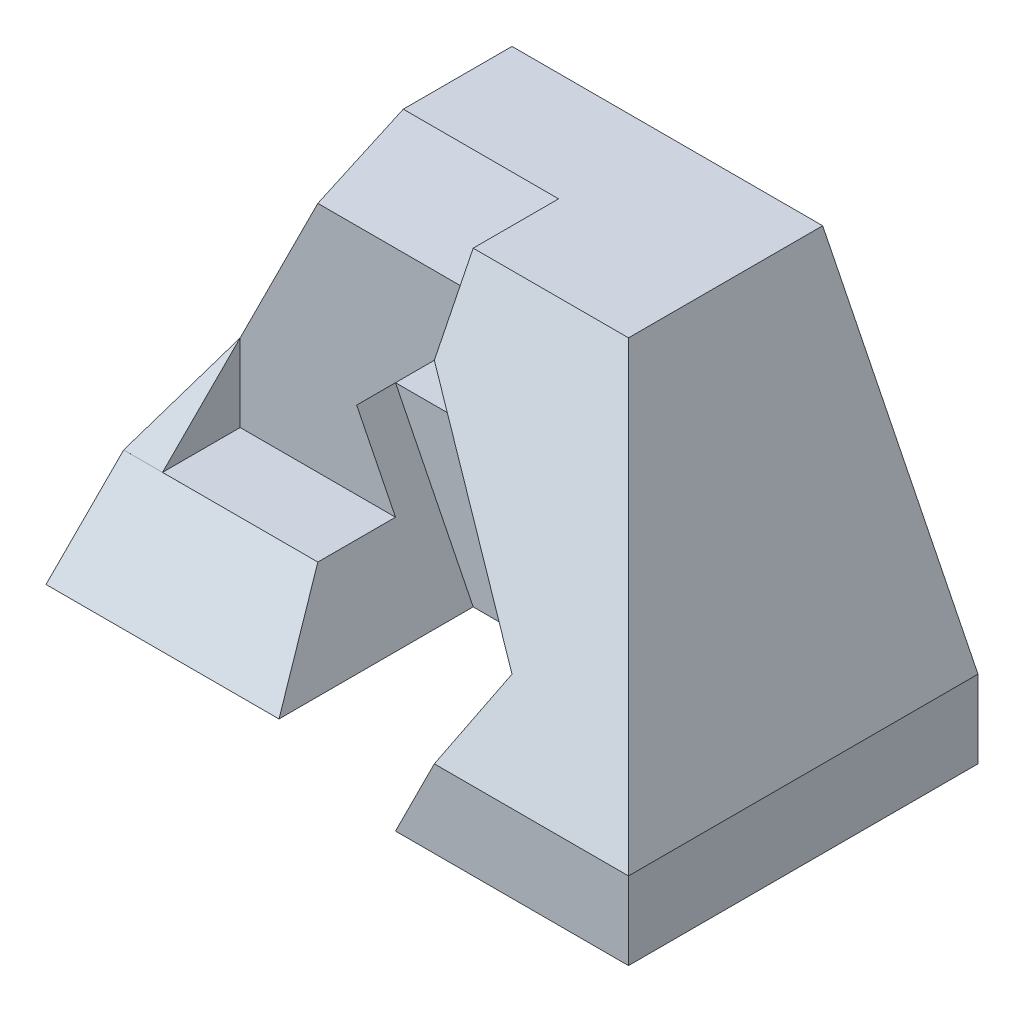
ISO-10303-21;
HEADER;
FILE_DESCRIPTION(('STEP AP214'),'2;1');
FILE_NAME('part.step','',(''),(''),'','','');
FILE_SCHEMA(('AUTOMOTIVE_DESIGN { 1 0 10303 214 1 1 1 1 }'));
ENDSEC;
DATA;
#1=APPLICATION_CONTEXT('core data for automotive mechanical design processes');
#2=APPLICATION_PROTOCOL_DEFINITION('international standard','automotive_design',2000,#1);
#3=PRODUCT_CONTEXT('',#1,'mechanical');
#4=PRODUCT('Part','Part','',(#3));
#5=PRODUCT_RELATED_PRODUCT_CATEGORY('part','',(#4));
#6=PRODUCT_DEFINITION_FORMATION('','',#4);
#7=PRODUCT_DEFINITION_CONTEXT('part definition',#1,'design');
#8=PRODUCT_DEFINITION('design','',#6,#7);
#9=PRODUCT_DEFINITION_SHAPE('','',#8);
#10=(LENGTH_UNIT() NAMED_UNIT(*) SI_UNIT(.MILLI.,.METRE.));
#11=(NAMED_UNIT(*) PLANE_ANGLE_UNIT() SI_UNIT($,.RADIAN.));
#12=(NAMED_UNIT(*) SI_UNIT($,.STERADIAN.) SOLID_ANGLE_UNIT());
#13=UNCERTAINTY_MEASURE_WITH_UNIT(LENGTH_MEASURE(1.E-05),#10,'distance_accuracy_value','');
#14=(GEOMETRIC_REPRESENTATION_CONTEXT(3) GLOBAL_UNCERTAINTY_ASSIGNED_CONTEXT((#13)) GLOBAL_UNIT_ASSIGNED_CONTEXT((#10,
#11,#12)) REPRESENTATION_CONTEXT('',''));
#15=CARTESIAN_POINT('',(0.,0.,0.));
#16=DIRECTION('',(0.,0.,1.));
#17=DIRECTION('',(1.,0.,0.));
#18=AXIS2_PLACEMENT_3D('',#15,#16,#17);
#19=CARTESIAN_POINT('',(0.,0.,0.));
#20=DIRECTION('',(0.,0.,-1.));
#21=DIRECTION('',(-1.,0.,0.));
#22=AXIS2_PLACEMENT_3D('',#19,#20,#21);
#23=PLANE('',#22);
#24=DIRECTION('',(0.707106781186547,0.707106781186548,0.));
#25=VECTOR('',#24,1.);
#26=CARTESIAN_POINT('',(0.,0.,0.));
#27=LINE('',#26,#25);
#28=CARTESIAN_POINT('',(40.,40.,0.));
#29=VERTEX_POINT('',#28);
#30=CARTESIAN_POINT('',(80.,80.,0.));
#31=VERTEX_POINT('',#30);
#32=EDGE_CURVE('E380',#29,#31,#27,.T.);
#33=ORIENTED_EDGE('',*,*,#32,.F.);
#34=DIRECTION('',(-1.,0.,0.));
#35=VECTOR('',#34,1.);
#36=CARTESIAN_POINT('',(0.,40.,0.));
#37=LINE('',#36,#35);
#38=CARTESIAN_POINT('',(120.,40.,0.));
#39=VERTEX_POINT('',#38);
#40=EDGE_CURVE('E376',#39,#29,#37,.T.);
#41=ORIENTED_EDGE('',*,*,#40,.F.);
#42=DIRECTION('',(0.707106781186548,-0.707106781186547,0.));
#43=VECTOR('',#42,1.);
#44=CARTESIAN_POINT('',(80.,80.,0.));
#45=LINE('',#44,#43);
#46=EDGE_CURVE('E378',#31,#39,#45,.T.);
#47=ORIENTED_EDGE('',*,*,#46,.F.);
#48=EDGE_LOOP('',(#33,#41,#47));
#49=FACE_BOUND('',#48,.T.);
#50=DIRECTION('',(-0.707106781186548,0.707106781186548,0.));
#51=VECTOR('',#50,1.);
#52=CARTESIAN_POINT('',(0.,20.,0.));
#53=LINE('',#52,#51);
#54=CARTESIAN_POINT('',(20.,0.,0.));
#55=VERTEX_POINT('',#54);
#56=CARTESIAN_POINT('',(0.,20.,0.));
#57=VERTEX_POINT('',#56);
#58=EDGE_CURVE('E268',#55,#57,#53,.T.);
#59=ORIENTED_EDGE('',*,*,#58,.T.);
#60=DIRECTION('',(-1.,0.,0.));
#61=VECTOR('',#60,1.);
#62=CARTESIAN_POINT('',(39.999,20.,0.));
#63=LINE('',#62,#61);
#64=CARTESIAN_POINT('',(39.999,20.,0.));
#65=VERTEX_POINT('',#64);
#66=EDGE_CURVE('E231',#65,#57,#63,.T.);
#67=ORIENTED_EDGE('',*,*,#66,.F.);
#68=DIRECTION('',(0.,1.,0.));
#69=VECTOR('',#68,1.);
#70=CARTESIAN_POINT('',(39.999,100.,0.));
#71=LINE('',#70,#69);
#72=CARTESIAN_POINT('',(39.999,99.998,0.));
#73=VERTEX_POINT('',#72);
#74=EDGE_CURVE('E224',#65,#73,#71,.T.);
#75=ORIENTED_EDGE('',*,*,#74,.T.);
#76=DIRECTION('',(0.447213595499958,0.894427190999916,0.));
#77=VECTOR('',#76,1.);
#78=CARTESIAN_POINT('',(-8.,4.,0.));
#79=LINE('',#78,#77);
#80=CARTESIAN_POINT('',(40.,100.,0.));
#81=VERTEX_POINT('',#80);
#82=EDGE_CURVE('E299',#73,#81,#79,.T.);
#83=ORIENTED_EDGE('',*,*,#82,.T.);
#84=DIRECTION('',(-1.,0.,0.));
#85=VECTOR('',#84,1.);
#86=CARTESIAN_POINT('',(40.,100.,0.));
#87=LINE('',#86,#85);
#88=CARTESIAN_POINT('',(120.,100.,0.));
#89=VERTEX_POINT('',#88);
#90=EDGE_CURVE('E317',#89,#81,#87,.T.);
#91=ORIENTED_EDGE('',*,*,#90,.F.);
#92=DIRECTION('',(-0.447213595499958,0.894427190999916,0.));
#93=VECTOR('',#92,1.);
#94=CARTESIAN_POINT('',(120.,100.,0.));
#95=LINE('',#94,#93);
#96=CARTESIAN_POINT('',(160.,20.,0.));
#97=VERTEX_POINT('',#96);
#98=EDGE_CURVE('E332',#97,#89,#95,.T.);
#99=ORIENTED_EDGE('',*,*,#98,.F.);
#100=DIRECTION('',(0.,1.,0.));
#101=VECTOR('',#100,1.);
#102=CARTESIAN_POINT('',(160.,20.,0.));
#103=LINE('',#102,#101);
#104=CARTESIAN_POINT('',(160.,0.,0.));
#105=VERTEX_POINT('',#104);
#106=EDGE_CURVE('E328',#105,#97,#103,.T.);
#107=ORIENTED_EDGE('',*,*,#106,.F.);
#108=DIRECTION('',(1.,0.,0.));
#109=VECTOR('',#108,1.);
#110=CARTESIAN_POINT('',(160.,0.,0.));
#111=LINE('',#110,#109);
#112=EDGE_CURVE('E323',#55,#105,#111,.T.);
#113=ORIENTED_EDGE('',*,*,#112,.F.);
#114=EDGE_LOOP('',(#59,#67,#75,#83,#91,#99,#107,#113));
#115=FACE_BOUND('',#114,.T.);
#116=ADVANCED_FACE('F35',(#49,#115),#23,.T.);
#117=CARTESIAN_POINT('',(-8.,4.,40.));
#118=DIRECTION('',(-0.894427190999916,0.447213595499958,0.));
#119=DIRECTION('',(-0.447213595499958,-0.894427190999916,0.));
#120=AXIS2_PLACEMENT_3D('',#117,#118,#119);
#121=PLANE('',#120);
#122=DIRECTION('',(0.,0.,1.));
#123=VECTOR('',#122,1.);
#124=CARTESIAN_POINT('',(39.999,99.998,40.));
#125=LINE('',#124,#123);
#126=CARTESIAN_POINT('',(39.999,99.998,0.000625000000016238));
#127=VERTEX_POINT('',#126);
#128=EDGE_CURVE('E43',#73,#127,#125,.T.);
#129=ORIENTED_EDGE('',*,*,#128,.T.);
#130=DIRECTION('',(-0.430705521646533,-0.861411043293065,0.269190951029083));
#131=VECTOR('',#130,1.);
#132=CARTESIAN_POINT('',(-9.15942028985508,1.68115942028986,30.7246376811594));
#133=LINE('',#132,#131);
#134=CARTESIAN_POINT('',(0.,20.,25.));
#135=VERTEX_POINT('',#134);
#136=EDGE_CURVE('E11',#127,#135,#133,.T.);
#137=ORIENTED_EDGE('',*,*,#136,.T.);
#138=DIRECTION('',(0.,0.,-1.));
#139=VECTOR('',#138,1.);
#140=CARTESIAN_POINT('',(0.,20.,40.));
#141=LINE('',#140,#139);
#142=CARTESIAN_POINT('',(0.,20.,60.));
#143=VERTEX_POINT('',#142);
#144=EDGE_CURVE('E307',#143,#135,#141,.T.);
#145=ORIENTED_EDGE('',*,*,#144,.F.);
#146=DIRECTION('',(-0.333329629737652,-0.666659259475304,0.666675925540138));
#147=VECTOR('',#146,1.);
#148=CARTESIAN_POINT('',(2.22217284122081,24.4443456824416,55.555543211694));
#149=LINE('',#148,#147);
#150=CARTESIAN_POINT('',(9.9997500124994,39.9995000249988,40.));
#151=VERTEX_POINT('',#150);
#152=EDGE_CURVE('E254',#151,#143,#149,.T.);
#153=ORIENTED_EDGE('',*,*,#152,.F.);
#154=DIRECTION('',(0.447213595499958,0.894427190999916,0.));
#155=VECTOR('',#154,1.);
#156=CARTESIAN_POINT('',(-8.,4.,40.));
#157=LINE('',#156,#155);
#158=CARTESIAN_POINT('',(30.,80.,40.));
#159=VERTEX_POINT('',#158);
#160=EDGE_CURVE('E300',#151,#159,#157,.T.);
#161=ORIENTED_EDGE('',*,*,#160,.T.);
#162=DIRECTION('',(-0.394055203119551,-0.788110406239101,0.47286624374346));
#163=VECTOR('',#162,1.);
#164=CARTESIAN_POINT('',(0.496894409937876,20.9937888198758,75.4037267080745));
#165=LINE('',#164,#163);
#166=CARTESIAN_POINT('',(40.,100.,28.));
#167=VERTEX_POINT('',#166);
#168=EDGE_CURVE('E265',#167,#159,#165,.T.);
#169=ORIENTED_EDGE('',*,*,#168,.F.);
#170=DIRECTION('',(0.,0.,-1.));
#171=VECTOR('',#170,1.);
#172=CARTESIAN_POINT('',(40.,100.,40.));
#173=LINE('',#172,#171);
#174=EDGE_CURVE('E305',#167,#81,#173,.T.);
#175=ORIENTED_EDGE('',*,*,#174,.T.);
#176=ORIENTED_EDGE('',*,*,#82,.F.);
#177=EDGE_LOOP('',(#129,#137,#145,#153,#161,#169,#175,#176));
#178=FACE_BOUND('',#177,.T.);
#179=ADVANCED_FACE('F384',(#178),#121,.T.);
#180=CARTESIAN_POINT('',(0.,0.,40.));
#181=DIRECTION('',(0.,0.,-1.));
#182=DIRECTION('',(-1.,0.,0.));
#183=AXIS2_PLACEMENT_3D('',#180,#181,#182);
#184=PLANE('',#183);
#185=DIRECTION('',(1.,0.,0.));
#186=VECTOR('',#185,1.);
#187=CARTESIAN_POINT('',(0.,20.,40.));
#188=LINE('',#187,#186);
#189=CARTESIAN_POINT('',(10.,20.,40.));
#190=VERTEX_POINT('',#189);
#191=CARTESIAN_POINT('',(50.,20.,40.));
#192=VERTEX_POINT('',#191);
#193=EDGE_CURVE('E302',#190,#192,#188,.T.);
#194=ORIENTED_EDGE('',*,*,#193,.T.);
#195=DIRECTION('',(0.447213595499958,-0.894427190999916,0.));
#196=VECTOR('',#195,1.);
#197=CARTESIAN_POINT('',(60.,0.,40.));
#198=LINE('',#197,#196);
#199=CARTESIAN_POINT('',(40.,40.,40.));
#200=VERTEX_POINT('',#199);
#201=EDGE_CURVE('E210',#200,#192,#198,.T.);
#202=ORIENTED_EDGE('',*,*,#201,.F.);
#203=DIRECTION('',(-0.707106781186547,-0.707106781186548,0.));
#204=VECTOR('',#203,1.);
#205=CARTESIAN_POINT('',(40.,40.,40.));
#206=LINE('',#205,#204);
#207=CARTESIAN_POINT('',(80.,80.,40.));
#208=VERTEX_POINT('',#207);
#209=EDGE_CURVE('E237',#208,#200,#206,.T.);
#210=ORIENTED_EDGE('',*,*,#209,.F.);
#211=DIRECTION('',(-1.,0.,0.));
#212=VECTOR('',#211,1.);
#213=CARTESIAN_POINT('',(0.,80.,40.));
#214=LINE('',#213,#212);
#215=EDGE_CURVE('E369',#208,#159,#214,.T.);
#216=ORIENTED_EDGE('',*,*,#215,.T.);
#217=ORIENTED_EDGE('',*,*,#160,.F.);
#218=DIRECTION('',(-1.,0.,0.));
#219=VECTOR('',#218,1.);
#220=CARTESIAN_POINT('',(20.,39.9995000249988,40.));
#221=LINE('',#220,#219);
#222=CARTESIAN_POINT('',(10.,39.9995000249988,40.));
#223=VERTEX_POINT('',#222);
#224=EDGE_CURVE('E257',#223,#151,#221,.T.);
#225=ORIENTED_EDGE('',*,*,#224,.F.);
#226=DIRECTION('',(0.,1.,0.));
#227=VECTOR('',#226,1.);
#228=CARTESIAN_POINT('',(10.,20.,40.));
#229=LINE('',#228,#227);
#230=EDGE_CURVE('E243',#190,#223,#229,.T.);
#231=ORIENTED_EDGE('',*,*,#230,.F.);
#232=EDGE_LOOP('',(#194,#202,#210,#216,#217,#225,#231));
#233=FACE_BOUND('',#232,.T.);
#234=ADVANCED_FACE('F419',(#233),#184,.F.);
#235=CARTESIAN_POINT('',(20.,0.,0.));
#236=DIRECTION('',(1.,0.,0.));
#237=DIRECTION('',(0.,0.,-1.));
#238=AXIS2_PLACEMENT_3D('',#235,#236,#237);
#239=PLANE('',#238);
#240=DIRECTION('',(0.,-1.,0.));
#241=VECTOR('',#240,1.);
#242=CARTESIAN_POINT('',(20.,0.,60.));
#243=LINE('',#242,#241);
#244=CARTESIAN_POINT('',(20.,20.,60.));
#245=VERTEX_POINT('',#244);
#246=CARTESIAN_POINT('',(20.,0.,60.));
#247=VERTEX_POINT('',#246);
#248=EDGE_CURVE('E272',#245,#247,#243,.T.);
#249=ORIENTED_EDGE('',*,*,#248,.T.);
#250=DIRECTION('',(0.,0.,1.));
#251=VECTOR('',#250,1.);
#252=CARTESIAN_POINT('',(20.,0.,0.));
#253=LINE('',#252,#251);
#254=CARTESIAN_POINT('',(20.,0.,60.0014999750012));
#255=VERTEX_POINT('',#254);
#256=EDGE_CURVE('E284',#247,#255,#253,.T.);
#257=ORIENTED_EDGE('',*,*,#256,.T.);
#258=DIRECTION('',(0.,1.,0.));
#259=VECTOR('',#258,1.);
#260=CARTESIAN_POINT('',(20.,0.,60.0014999750012));
#261=LINE('',#260,#259);
#262=CARTESIAN_POINT('',(20.,20.,60.0014999750012));
#263=VERTEX_POINT('',#262);
#264=EDGE_CURVE('E283',#255,#263,#261,.T.);
#265=ORIENTED_EDGE('',*,*,#264,.T.);
#266=DIRECTION('',(0.,0.,-1.));
#267=VECTOR('',#266,1.);
#268=CARTESIAN_POINT('',(20.,20.,0.));
#269=LINE('',#268,#267);
#270=EDGE_CURVE('E287',#263,#245,#269,.T.);
#271=ORIENTED_EDGE('',*,*,#270,.T.);
#272=EDGE_LOOP('',(#249,#257,#265,#271));
#273=FACE_BOUND('',#272,.T.);
#274=ADVANCED_FACE('F447',(#273),#239,.F.);
#275=CARTESIAN_POINT('',(80.,0.,119.));
#276=DIRECTION('',(-1.,0.,0.));
#277=DIRECTION('',(0.,0.,1.));
#278=AXIS2_PLACEMENT_3D('',#275,#276,#277);
#279=PLANE('',#278);
#280=DIRECTION('',(0.,0.857492925712544,-0.514495755427526));
#281=VECTOR('',#280,1.);
#282=CARTESIAN_POINT('',(80.,80.,40.));
#283=LINE('',#282,#281);
#284=CARTESIAN_POINT('',(80.,100.,28.));
#285=VERTEX_POINT('',#284);
#286=EDGE_CURVE('E259',#208,#285,#283,.T.);
#287=ORIENTED_EDGE('',*,*,#286,.F.);
#288=DIRECTION('',(0.,0.,1.));
#289=VECTOR('',#288,1.);
#290=CARTESIAN_POINT('',(80.,80.,50.));
#291=LINE('',#290,#289);
#292=CARTESIAN_POINT('',(80.,80.,60.));
#293=VERTEX_POINT('',#292);
#294=EDGE_CURVE('E355',#208,#293,#291,.T.);
#295=ORIENTED_EDGE('',*,*,#294,.T.);
#296=DIRECTION('',(0.,0.894427190999916,-0.447213595499958));
#297=VECTOR('',#296,1.);
#298=CARTESIAN_POINT('',(80.,40.,80.));
#299=LINE('',#298,#297);
#300=CARTESIAN_POINT('',(80.,100.,50.));
#301=VERTEX_POINT('',#300);
#302=EDGE_CURVE('E354',#293,#301,#299,.T.);
#303=ORIENTED_EDGE('',*,*,#302,.T.);
#304=DIRECTION('',(0.,0.,-1.));
#305=VECTOR('',#304,1.);
#306=CARTESIAN_POINT('',(80.,100.,119.));
#307=LINE('',#306,#305);
#308=EDGE_CURVE('E358',#301,#285,#307,.T.);
#309=ORIENTED_EDGE('',*,*,#308,.T.);
#310=EDGE_LOOP('',(#287,#295,#303,#309));
#311=FACE_BOUND('',#310,.T.);
#312=ADVANCED_FACE('F504',(#311),#279,.T.);
#313=CARTESIAN_POINT('',(0.,20.,119.));
#314=DIRECTION('',(0.,1.,0.));
#315=DIRECTION('',(-1.,0.,0.));
#316=AXIS2_PLACEMENT_3D('',#313,#314,#315);
#317=PLANE('',#316);
#318=ORIENTED_EDGE('',*,*,#193,.F.);
#319=DIRECTION('',(0.,0.,-1.));
#320=VECTOR('',#319,1.);
#321=CARTESIAN_POINT('',(10.,20.,60.0014999750012));
#322=LINE('',#321,#320);
#323=CARTESIAN_POINT('',(10.,20.,60.));
#324=VERTEX_POINT('',#323);
#325=EDGE_CURVE('E248',#324,#190,#322,.T.);
#326=ORIENTED_EDGE('',*,*,#325,.F.);
#327=DIRECTION('',(-1.,0.,0.));
#328=VECTOR('',#327,1.);
#329=CARTESIAN_POINT('',(20.,20.,60.));
#330=LINE('',#329,#328);
#331=EDGE_CURVE('E251',#245,#324,#330,.T.);
#332=ORIENTED_EDGE('',*,*,#331,.F.);
#333=ORIENTED_EDGE('',*,*,#270,.F.);
#334=DIRECTION('',(-1.,0.,0.));
#335=VECTOR('',#334,1.);
#336=CARTESIAN_POINT('',(69.,20.,60.0014999750012));
#337=LINE('',#336,#335);
#338=CARTESIAN_POINT('',(50.,20.,60.0014999750012));
#339=VERTEX_POINT('',#338);
#340=EDGE_CURVE('E366',#339,#263,#337,.T.);
#341=ORIENTED_EDGE('',*,*,#340,.F.);
#342=DIRECTION('',(0.,0.,-1.));
#343=VECTOR('',#342,1.);
#344=CARTESIAN_POINT('',(50.,20.,119.));
#345=LINE('',#344,#343);
#346=EDGE_CURVE('E357',#339,#192,#345,.T.);
#347=ORIENTED_EDGE('',*,*,#346,.T.);
#348=EDGE_LOOP('',(#318,#326,#332,#333,#341,#347));
#349=FACE_BOUND('',#348,.T.);
#350=ADVANCED_FACE('F413',(#349),#317,.T.);
#351=CARTESIAN_POINT('',(120.,40.,50.));
#352=DIRECTION('',(0.707106781186547,0.707106781186548,0.));
#353=DIRECTION('',(-0.707106781186548,0.707106781186547,0.));
#354=AXIS2_PLACEMENT_3D('',#351,#352,#353);
#355=PLANE('',#354);
#356=ORIENTED_EDGE('',*,*,#294,.F.);
#357=DIRECTION('',(0.,0.,1.));
#358=VECTOR('',#357,1.);
#359=CARTESIAN_POINT('',(80.,80.,-102.));
#360=LINE('',#359,#358);
#361=EDGE_CURVE('E241',#31,#208,#360,.T.);
#362=ORIENTED_EDGE('',*,*,#361,.F.);
#363=ORIENTED_EDGE('',*,*,#46,.T.);
#364=DIRECTION('',(0.,0.,1.));
#365=VECTOR('',#364,1.);
#366=CARTESIAN_POINT('',(120.,40.,-102.));
#367=LINE('',#366,#365);
#368=CARTESIAN_POINT('',(120.,40.,30.));
#369=VERTEX_POINT('',#368);
#370=EDGE_CURVE('E58',#39,#369,#367,.T.);
#371=ORIENTED_EDGE('',*,*,#370,.T.);
#372=DIRECTION('',(0.,0.,1.));
#373=VECTOR('',#372,1.);
#374=CARTESIAN_POINT('',(120.,40.,50.));
#375=LINE('',#374,#373);
#376=CARTESIAN_POINT('',(120.,40.,80.));
#377=VERTEX_POINT('',#376);
#378=EDGE_CURVE('E50',#369,#377,#375,.T.);
#379=ORIENTED_EDGE('',*,*,#378,.T.);
#380=DIRECTION('',(0.666666666666667,-0.666666666666667,0.333333333333333));
#381=VECTOR('',#380,1.);
#382=CARTESIAN_POINT('',(178.222222222222,-18.2222222222222,109.111111111111));
#383=LINE('',#382,#381);
#384=EDGE_CURVE('E313',#293,#377,#383,.T.);
#385=ORIENTED_EDGE('',*,*,#384,.F.);
#386=EDGE_LOOP('',(#356,#362,#363,#371,#379,#385));
#387=FACE_BOUND('',#386,.T.);
#388=ADVANCED_FACE('F462',(#387),#355,.F.);
#389=CARTESIAN_POINT('',(50.,20.,44.001));
#390=DIRECTION('',(0.894427190999916,0.447213595499958,0.));
#391=DIRECTION('',(-0.447213595499958,0.894427190999916,0.));
#392=AXIS2_PLACEMENT_3D('',#389,#390,#391);
#393=PLANE('',#392);
#394=DIRECTION('',(0.,0.,1.));
#395=VECTOR('',#394,1.);
#396=CARTESIAN_POINT('',(60.,0.,44.001));
#397=LINE('',#396,#395);
#398=CARTESIAN_POINT('',(60.,0.,30.));
#399=VERTEX_POINT('',#398);
#400=CARTESIAN_POINT('',(60.,0.,80.001));
#401=VERTEX_POINT('',#400);
#402=EDGE_CURVE('E191',#399,#401,#397,.T.);
#403=ORIENTED_EDGE('',*,*,#402,.F.);
#404=DIRECTION('',(0.447213595499958,-0.894427190999916,0.));
#405=VECTOR('',#404,1.);
#406=CARTESIAN_POINT('',(60.,0.,30.));
#407=LINE('',#406,#405);
#408=CARTESIAN_POINT('',(40.,40.,30.));
#409=VERTEX_POINT('',#408);
#410=EDGE_CURVE('E193',#409,#399,#407,.T.);
#411=ORIENTED_EDGE('',*,*,#410,.F.);
#412=DIRECTION('',(0.,0.,1.));
#413=VECTOR('',#412,1.);
#414=CARTESIAN_POINT('',(40.,40.,30.));
#415=LINE('',#414,#413);
#416=EDGE_CURVE('E220',#409,#200,#415,.T.);
#417=ORIENTED_EDGE('',*,*,#416,.T.);
#418=ORIENTED_EDGE('',*,*,#201,.T.);
#419=ORIENTED_EDGE('',*,*,#346,.F.);
#420=DIRECTION('',(-0.333337036867291,0.666674073734583,-0.66665740771604));
#421=VECTOR('',#420,1.);
#422=CARTESIAN_POINT('',(46.4443432164537,27.1113135670926,52.8903641818591));
#423=LINE('',#422,#421);
#424=EDGE_CURVE('E196',#401,#339,#423,.T.);
#425=ORIENTED_EDGE('',*,*,#424,.F.);
#426=EDGE_LOOP('',(#403,#411,#417,#418,#419,#425));
#427=FACE_BOUND('',#426,.T.);
#428=ADVANCED_FACE('F37',(#427),#393,.T.);
#429=CARTESIAN_POINT('',(100.,0.,50.));
#430=DIRECTION('',(0.894427190999916,-0.447213595499958,0.));
#431=DIRECTION('',(0.447213595499958,0.894427190999916,0.));
#432=AXIS2_PLACEMENT_3D('',#429,#430,#431);
#433=PLANE('',#432);
#434=ORIENTED_EDGE('',*,*,#378,.F.);
#435=DIRECTION('',(0.447213595499958,0.894427190999916,0.));
#436=VECTOR('',#435,1.);
#437=CARTESIAN_POINT('',(120.,40.,30.));
#438=LINE('',#437,#436);
#439=CARTESIAN_POINT('',(100.,0.,30.));
#440=VERTEX_POINT('',#439);
#441=EDGE_CURVE('E215',#440,#369,#438,.T.);
#442=ORIENTED_EDGE('',*,*,#441,.F.);
#443=DIRECTION('',(0.,0.,1.));
#444=VECTOR('',#443,1.);
#445=CARTESIAN_POINT('',(100.,0.,50.));
#446=LINE('',#445,#444);
#447=CARTESIAN_POINT('',(100.,0.,90.));
#448=VERTEX_POINT('',#447);
#449=EDGE_CURVE('E214',#440,#448,#446,.T.);
#450=ORIENTED_EDGE('',*,*,#449,.T.);
#451=DIRECTION('',(-0.447213595499958,-0.894427190999916,0.));
#452=VECTOR('',#451,1.);
#453=CARTESIAN_POINT('',(100.,0.,90.));
#454=LINE('',#453,#452);
#455=CARTESIAN_POINT('',(110.,20.,90.));
#456=VERTEX_POINT('',#455);
#457=EDGE_CURVE('E322',#456,#448,#454,.T.);
#458=ORIENTED_EDGE('',*,*,#457,.F.);
#459=DIRECTION('',(-0.408248290463863,-0.816496580927726,0.408248290463863));
#460=VECTOR('',#459,1.);
#461=CARTESIAN_POINT('',(141.833333333333,83.6666666666667,58.1666666666667));
#462=LINE('',#461,#460);
#463=EDGE_CURVE('E316',#377,#456,#462,.T.);
#464=ORIENTED_EDGE('',*,*,#463,.F.);
#465=EDGE_LOOP('',(#434,#442,#450,#458,#464));
#466=FACE_BOUND('',#465,.T.);
#467=ADVANCED_FACE('F471',(#466),#433,.F.);
#468=CARTESIAN_POINT('',(40.,100.,90.));
#469=DIRECTION('',(0.,-1.,0.));
#470=DIRECTION('',(0.,0.,-1.));
#471=AXIS2_PLACEMENT_3D('',#468,#469,#470);
#472=PLANE('',#471);
#473=ORIENTED_EDGE('',*,*,#174,.F.);
#474=DIRECTION('',(1.,0.,0.));
#475=VECTOR('',#474,1.);
#476=CARTESIAN_POINT('',(20.,100.,28.));
#477=LINE('',#476,#475);
#478=EDGE_CURVE('E262',#167,#285,#477,.T.);
#479=ORIENTED_EDGE('',*,*,#478,.T.);
#480=ORIENTED_EDGE('',*,*,#308,.F.);
#481=DIRECTION('',(-1.,0.,0.));
#482=VECTOR('',#481,1.);
#483=CARTESIAN_POINT('',(251.,100.,50.));
#484=LINE('',#483,#482);
#485=CARTESIAN_POINT('',(120.,100.,50.));
#486=VERTEX_POINT('',#485);
#487=EDGE_CURVE('E202',#486,#301,#484,.T.);
#488=ORIENTED_EDGE('',*,*,#487,.F.);
#489=DIRECTION('',(0.,0.,-1.));
#490=VECTOR('',#489,1.);
#491=CARTESIAN_POINT('',(120.,100.,90.));
#492=LINE('',#491,#490);
#493=EDGE_CURVE('E310',#486,#89,#492,.T.);
#494=ORIENTED_EDGE('',*,*,#493,.T.);
#495=ORIENTED_EDGE('',*,*,#90,.T.);
#496=EDGE_LOOP('',(#473,#479,#480,#488,#494,#495));
#497=FACE_BOUND('',#496,.T.);
#498=ADVANCED_FACE('F430',(#497),#472,.F.);
#499=CARTESIAN_POINT('',(20.,40.0004999875008,40.0014999750008));
#500=DIRECTION('',(0.,-0.707097942627989,-0.707115619634629));
#501=DIRECTION('',(0.,0.707115619634629,-0.707097942627989));
#502=AXIS2_PLACEMENT_3D('',#499,#500,#501);
#503=PLANE('',#502);
#504=ORIENTED_EDGE('',*,*,#340,.T.);
#505=DIRECTION('',(-1.,0.,0.));
#506=VECTOR('',#505,1.);
#507=CARTESIAN_POINT('',(20.,20.,60.0014999750012));
#508=LINE('',#507,#506);
#509=CARTESIAN_POINT('',(0.,20.,60.0014999750012));
#510=VERTEX_POINT('',#509);
#511=EDGE_CURVE('E293',#263,#510,#508,.T.);
#512=ORIENTED_EDGE('',*,*,#511,.T.);
#513=DIRECTION('',(0.,0.707115619634629,-0.707097942627989));
#514=VECTOR('',#513,1.);
#515=CARTESIAN_POINT('',(0.,0.,80.001));
#516=LINE('',#515,#514);
#517=CARTESIAN_POINT('',(0.,0.,80.001));
#518=VERTEX_POINT('',#517);
#519=EDGE_CURVE('E295',#518,#510,#516,.T.);
#520=ORIENTED_EDGE('',*,*,#519,.F.);
#521=DIRECTION('',(-1.,0.,0.));
#522=VECTOR('',#521,1.);
#523=CARTESIAN_POINT('',(69.,0.,80.001));
#524=LINE('',#523,#522);
#525=EDGE_CURVE('E201',#401,#518,#524,.T.);
#526=ORIENTED_EDGE('',*,*,#525,.F.);
#527=ORIENTED_EDGE('',*,*,#424,.T.);
#528=EDGE_LOOP('',(#504,#512,#520,#526,#527));
#529=FACE_BOUND('',#528,.T.);
#530=ADVANCED_FACE('F453',(#529),#503,.F.);
#531=CARTESIAN_POINT('',(0.,0.,90.));
#532=DIRECTION('',(1.,0.,0.));
#533=DIRECTION('',(0.,0.,-1.));
#534=AXIS2_PLACEMENT_3D('',#531,#532,#533);
#535=PLANE('',#534);
#536=ORIENTED_EDGE('',*,*,#519,.T.);
#537=DIRECTION('',(0.,1.,0.));
#538=VECTOR('',#537,1.);
#539=CARTESIAN_POINT('',(0.,0.,60.0014999750012));
#540=LINE('',#539,#538);
#541=CARTESIAN_POINT('',(0.,0.,60.0014999750012));
#542=VERTEX_POINT('',#541);
#543=EDGE_CURVE('E277',#542,#510,#540,.T.);
#544=ORIENTED_EDGE('',*,*,#543,.F.);
#545=DIRECTION('',(0.,0.,-1.));
#546=VECTOR('',#545,1.);
#547=CARTESIAN_POINT('',(0.,0.,90.));
#548=LINE('',#547,#546);
#549=EDGE_CURVE('E334',#518,#542,#548,.T.);
#550=ORIENTED_EDGE('',*,*,#549,.F.);
#551=EDGE_LOOP('',(#536,#544,#550));
#552=FACE_BOUND('',#551,.T.);
#553=ADVANCED_FACE('F490',(#552),#535,.F.);
#554=CARTESIAN_POINT('',(251.,40.,80.));
#555=DIRECTION('',(0.,-0.447213595499958,-0.894427190999916));
#556=DIRECTION('',(0.,0.894427190999916,-0.447213595499958));
#557=AXIS2_PLACEMENT_3D('',#554,#555,#556);
#558=PLANE('',#557);
#559=ORIENTED_EDGE('',*,*,#302,.F.);
#560=ORIENTED_EDGE('',*,*,#384,.T.);
#561=ORIENTED_EDGE('',*,*,#463,.T.);
#562=DIRECTION('',(-1.,0.,0.));
#563=VECTOR('',#562,1.);
#564=CARTESIAN_POINT('',(0.,20.,90.));
#565=LINE('',#564,#563);
#566=CARTESIAN_POINT('',(160.,20.,90.));
#567=VERTEX_POINT('',#566);
#568=EDGE_CURVE('E320',#567,#456,#565,.T.);
#569=ORIENTED_EDGE('',*,*,#568,.F.);
#570=DIRECTION('',(0.408248290463863,-0.816496580927726,0.408248290463863));
#571=VECTOR('',#570,1.);
#572=CARTESIAN_POINT('',(126.666666666667,86.6666666666667,56.6666666666667));
#573=LINE('',#572,#571);
#574=EDGE_CURVE('E327',#486,#567,#573,.T.);
#575=ORIENTED_EDGE('',*,*,#574,.F.);
#576=ORIENTED_EDGE('',*,*,#487,.T.);
#577=EDGE_LOOP('',(#559,#560,#561,#569,#575,#576));
#578=FACE_BOUND('',#577,.T.);
#579=ADVANCED_FACE('F469',(#578),#558,.F.);
#580=CARTESIAN_POINT('',(160.,0.,90.));
#581=DIRECTION('',(0.,1.,0.));
#582=DIRECTION('',(0.,0.,1.));
#583=AXIS2_PLACEMENT_3D('',#580,#581,#582);
#584=PLANE('',#583);
#585=DIRECTION('',(1.,0.,0.));
#586=VECTOR('',#585,1.);
#587=CARTESIAN_POINT('',(100.,0.,30.));
#588=LINE('',#587,#586);
#589=EDGE_CURVE('E207',#399,#440,#588,.T.);
#590=ORIENTED_EDGE('',*,*,#589,.F.);
#591=ORIENTED_EDGE('',*,*,#402,.T.);
#592=ORIENTED_EDGE('',*,*,#525,.T.);
#593=ORIENTED_EDGE('',*,*,#549,.T.);
#594=DIRECTION('',(-1.,0.,0.));
#595=VECTOR('',#594,1.);
#596=CARTESIAN_POINT('',(20.,0.,60.0014999750012));
#597=LINE('',#596,#595);
#598=EDGE_CURVE('E290',#255,#542,#597,.T.);
#599=ORIENTED_EDGE('',*,*,#598,.F.);
#600=ORIENTED_EDGE('',*,*,#256,.F.);
#601=EDGE_CURVE('E280',#55,#247,#253,.T.);
#602=ORIENTED_EDGE('',*,*,#601,.F.);
#603=ORIENTED_EDGE('',*,*,#112,.T.);
#604=DIRECTION('',(0.,0.,-1.));
#605=VECTOR('',#604,1.);
#606=CARTESIAN_POINT('',(160.,0.,90.));
#607=LINE('',#606,#605);
#608=CARTESIAN_POINT('',(160.,0.,90.));
#609=VERTEX_POINT('',#608);
#610=EDGE_CURVE('E324',#609,#105,#607,.T.);
#611=ORIENTED_EDGE('',*,*,#610,.F.);
#612=DIRECTION('',(1.,0.,0.));
#613=VECTOR('',#612,1.);
#614=CARTESIAN_POINT('',(160.,0.,90.));
#615=LINE('',#614,#613);
#616=EDGE_CURVE('E346',#448,#609,#615,.T.);
#617=ORIENTED_EDGE('',*,*,#616,.F.);
#618=ORIENTED_EDGE('',*,*,#449,.F.);
#619=EDGE_LOOP('',(#590,#591,#592,#593,#599,#600,#602,#603,#611,#617,#618));
#620=FACE_BOUND('',#619,.T.);
#621=ADVANCED_FACE('F212',(#620),#584,.F.);
#622=CARTESIAN_POINT('',(0.,0.,90.));
#623=DIRECTION('',(0.,0.,-1.));
#624=DIRECTION('',(-1.,0.,0.));
#625=AXIS2_PLACEMENT_3D('',#622,#623,#624);
#626=PLANE('',#625);
#627=ORIENTED_EDGE('',*,*,#568,.T.);
#628=ORIENTED_EDGE('',*,*,#457,.T.);
#629=ORIENTED_EDGE('',*,*,#616,.T.);
#630=DIRECTION('',(0.,1.,0.));
#631=VECTOR('',#630,1.);
#632=CARTESIAN_POINT('',(160.,20.,90.));
#633=LINE('',#632,#631);
#634=EDGE_CURVE('E343',#609,#567,#633,.T.);
#635=ORIENTED_EDGE('',*,*,#634,.T.);
#636=EDGE_LOOP('',(#627,#628,#629,#635));
#637=FACE_BOUND('',#636,.T.);
#638=ADVANCED_FACE('F473',(#637),#626,.F.);
#639=CARTESIAN_POINT('',(160.,20.,90.));
#640=DIRECTION('',(-1.,0.,0.));
#641=DIRECTION('',(0.,0.,1.));
#642=AXIS2_PLACEMENT_3D('',#639,#640,#641);
#643=PLANE('',#642);
#644=ORIENTED_EDGE('',*,*,#106,.T.);
#645=DIRECTION('',(0.,0.,-1.));
#646=VECTOR('',#645,1.);
#647=CARTESIAN_POINT('',(160.,20.,90.));
#648=LINE('',#647,#646);
#649=EDGE_CURVE('E329',#567,#97,#648,.T.);
#650=ORIENTED_EDGE('',*,*,#649,.F.);
#651=ORIENTED_EDGE('',*,*,#634,.F.);
#652=ORIENTED_EDGE('',*,*,#610,.T.);
#653=EDGE_LOOP('',(#644,#650,#651,#652));
#654=FACE_BOUND('',#653,.T.);
#655=ADVANCED_FACE('F440',(#654),#643,.F.);
#656=CARTESIAN_POINT('',(120.,100.,90.));
#657=DIRECTION('',(-0.894427190999916,-0.447213595499958,0.));
#658=DIRECTION('',(0.447213595499958,-0.894427190999916,0.));
#659=AXIS2_PLACEMENT_3D('',#656,#657,#658);
#660=PLANE('',#659);
#661=ORIENTED_EDGE('',*,*,#493,.F.);
#662=ORIENTED_EDGE('',*,*,#574,.T.);
#663=ORIENTED_EDGE('',*,*,#649,.T.);
#664=ORIENTED_EDGE('',*,*,#98,.T.);
#665=EDGE_LOOP('',(#661,#662,#663,#664));
#666=FACE_BOUND('',#665,.T.);
#667=ADVANCED_FACE('F436',(#666),#660,.F.);
#668=CARTESIAN_POINT('',(20.,0.,60.0014999750012));
#669=DIRECTION('',(0.,0.,1.));
#670=DIRECTION('',(1.,0.,0.));
#671=AXIS2_PLACEMENT_3D('',#668,#669,#670);
#672=PLANE('',#671);
#673=ORIENTED_EDGE('',*,*,#543,.T.);
#674=ORIENTED_EDGE('',*,*,#511,.F.);
#675=ORIENTED_EDGE('',*,*,#264,.F.);
#676=ORIENTED_EDGE('',*,*,#598,.T.);
#677=EDGE_LOOP('',(#673,#674,#675,#676));
#678=FACE_BOUND('',#677,.T.);
#679=ADVANCED_FACE('F449',(#678),#672,.F.);
#680=CARTESIAN_POINT('',(0.,20.,60.));
#681=DIRECTION('',(-0.707106781186547,-0.707106781186547,0.));
#682=DIRECTION('',(0.707106781186548,-0.707106781186548,0.));
#683=AXIS2_PLACEMENT_3D('',#680,#681,#682);
#684=PLANE('',#683);
#685=ORIENTED_EDGE('',*,*,#58,.F.);
#686=ORIENTED_EDGE('',*,*,#601,.T.);
#687=DIRECTION('',(-0.707106781186548,0.707106781186548,0.));
#688=VECTOR('',#687,1.);
#689=CARTESIAN_POINT('',(0.,20.,60.));
#690=LINE('',#689,#688);
#691=EDGE_CURVE('E274',#247,#143,#690,.T.);
#692=ORIENTED_EDGE('',*,*,#691,.T.);
#693=ORIENTED_EDGE('',*,*,#144,.T.);
#694=DIRECTION('',(0.,0.,-1.));
#695=VECTOR('',#694,1.);
#696=CARTESIAN_POINT('',(0.,20.,0.));
#697=LINE('',#696,#695);
#698=EDGE_CURVE('E223',#135,#57,#697,.T.);
#699=ORIENTED_EDGE('',*,*,#698,.T.);
#700=EDGE_LOOP('',(#685,#686,#692,#693,#699));
#701=FACE_BOUND('',#700,.T.);
#702=ADVANCED_FACE('F399',(#701),#684,.T.);
#703=CARTESIAN_POINT('',(0.,0.,60.));
#704=DIRECTION('',(0.,0.,-1.));
#705=DIRECTION('',(-1.,0.,0.));
#706=AXIS2_PLACEMENT_3D('',#703,#704,#705);
#707=PLANE('',#706);
#708=DIRECTION('',(1.,0.,0.));
#709=VECTOR('',#708,1.);
#710=CARTESIAN_POINT('',(20.,20.,60.));
#711=LINE('',#710,#709);
#712=EDGE_CURVE('E269',#143,#324,#711,.T.);
#713=ORIENTED_EDGE('',*,*,#712,.F.);
#714=ORIENTED_EDGE('',*,*,#691,.F.);
#715=ORIENTED_EDGE('',*,*,#248,.F.);
#716=ORIENTED_EDGE('',*,*,#331,.T.);
#717=EDGE_LOOP('',(#713,#714,#715,#716));
#718=FACE_BOUND('',#717,.T.);
#719=ADVANCED_FACE('F408',(#718),#707,.F.);
#720=CARTESIAN_POINT('',(20.,80.,40.));
#721=DIRECTION('',(0.,-0.514495755427526,-0.857492925712544));
#722=DIRECTION('',(0.,0.857492925712545,-0.514495755427526));
#723=AXIS2_PLACEMENT_3D('',#720,#721,#722);
#724=PLANE('',#723);
#725=ORIENTED_EDGE('',*,*,#168,.T.);
#726=ORIENTED_EDGE('',*,*,#215,.F.);
#727=ORIENTED_EDGE('',*,*,#286,.T.);
#728=ORIENTED_EDGE('',*,*,#478,.F.);
#729=EDGE_LOOP('',(#725,#726,#727,#728));
#730=FACE_BOUND('',#729,.T.);
#731=ADVANCED_FACE('F426',(#730),#724,.F.);
#732=CARTESIAN_POINT('',(20.,20.,60.));
#733=DIRECTION('',(0.,-0.707115619634629,-0.707097942627989));
#734=DIRECTION('',(0.,0.707097942627989,-0.707115619634629));
#735=AXIS2_PLACEMENT_3D('',#732,#733,#734);
#736=PLANE('',#735);
#737=ORIENTED_EDGE('',*,*,#712,.T.);
#738=DIRECTION('',(0.,0.707097942627989,-0.707115619634629));
#739=VECTOR('',#738,1.);
#740=CARTESIAN_POINT('',(10.,20.,60.));
#741=LINE('',#740,#739);
#742=EDGE_CURVE('E373',#324,#223,#741,.T.);
#743=ORIENTED_EDGE('',*,*,#742,.T.);
#744=ORIENTED_EDGE('',*,*,#224,.T.);
#745=ORIENTED_EDGE('',*,*,#152,.T.);
#746=EDGE_LOOP('',(#737,#743,#744,#745));
#747=FACE_BOUND('',#746,.T.);
#748=ADVANCED_FACE('F405',(#747),#736,.F.);
#749=CARTESIAN_POINT('',(10.,0.,0.));
#750=DIRECTION('',(-1.,0.,0.));
#751=DIRECTION('',(0.,0.,1.));
#752=AXIS2_PLACEMENT_3D('',#749,#750,#751);
#753=PLANE('',#752);
#754=ORIENTED_EDGE('',*,*,#325,.T.);
#755=ORIENTED_EDGE('',*,*,#230,.T.);
#756=ORIENTED_EDGE('',*,*,#742,.F.);
#757=EDGE_LOOP('',(#754,#755,#756));
#758=FACE_BOUND('',#757,.T.);
#759=ADVANCED_FACE('F417',(#758),#753,.F.);
#760=CARTESIAN_POINT('',(40.,40.,-102.));
#761=DIRECTION('',(-0.707106781186548,0.707106781186547,0.));
#762=DIRECTION('',(-0.707106781186547,-0.707106781186548,0.));
#763=AXIS2_PLACEMENT_3D('',#760,#761,#762);
#764=PLANE('',#763);
#765=ORIENTED_EDGE('',*,*,#32,.T.);
#766=ORIENTED_EDGE('',*,*,#361,.T.);
#767=ORIENTED_EDGE('',*,*,#209,.T.);
#768=ORIENTED_EDGE('',*,*,#416,.F.);
#769=DIRECTION('',(0.,0.,1.));
#770=VECTOR('',#769,1.);
#771=CARTESIAN_POINT('',(40.,40.,-102.));
#772=LINE('',#771,#770);
#773=EDGE_CURVE('E240',#29,#409,#772,.T.);
#774=ORIENTED_EDGE('',*,*,#773,.F.);
#775=EDGE_LOOP('',(#765,#766,#767,#768,#774));
#776=FACE_BOUND('',#775,.T.);
#777=ADVANCED_FACE('F456',(#776),#764,.F.);
#778=CARTESIAN_POINT('',(120.,40.,-102.));
#779=DIRECTION('',(0.,-1.,0.));
#780=DIRECTION('',(0.,0.,-1.));
#781=AXIS2_PLACEMENT_3D('',#778,#779,#780);
#782=PLANE('',#781);
#783=ORIENTED_EDGE('',*,*,#773,.T.);
#784=DIRECTION('',(-1.,0.,0.));
#785=VECTOR('',#784,1.);
#786=CARTESIAN_POINT('',(40.,40.,30.));
#787=LINE('',#786,#785);
#788=EDGE_CURVE('E208',#369,#409,#787,.T.);
#789=ORIENTED_EDGE('',*,*,#788,.F.);
#790=ORIENTED_EDGE('',*,*,#370,.F.);
#791=ORIENTED_EDGE('',*,*,#40,.T.);
#792=EDGE_LOOP('',(#783,#789,#790,#791));
#793=FACE_BOUND('',#792,.T.);
#794=ADVANCED_FACE('F466',(#793),#782,.F.);
#795=CARTESIAN_POINT('',(39.999,20.,25.));
#796=DIRECTION('',(0.,-0.298274993135947,-0.95447997803503));
#797=DIRECTION('',(0.,0.95447997803503,-0.298274993135947));
#798=AXIS2_PLACEMENT_3D('',#795,#796,#797);
#799=PLANE('',#798);
#800=DIRECTION('',(0.,-0.95447997803503,0.298274993135947));
#801=VECTOR('',#800,1.);
#802=CARTESIAN_POINT('',(39.999,20.,25.));
#803=LINE('',#802,#801);
#804=CARTESIAN_POINT('',(39.999,20.,25.));
#805=VERTEX_POINT('',#804);
#806=EDGE_CURVE('E227',#127,#805,#803,.T.);
#807=ORIENTED_EDGE('',*,*,#806,.T.);
#808=DIRECTION('',(-1.,0.,0.));
#809=VECTOR('',#808,1.);
#810=CARTESIAN_POINT('',(39.999,20.,25.));
#811=LINE('',#810,#809);
#812=EDGE_CURVE('E235',#805,#135,#811,.T.);
#813=ORIENTED_EDGE('',*,*,#812,.T.);
#814=ORIENTED_EDGE('',*,*,#136,.F.);
#815=EDGE_LOOP('',(#807,#813,#814));
#816=FACE_BOUND('',#815,.T.);
#817=ADVANCED_FACE('F519',(#816),#799,.T.);
#818=CARTESIAN_POINT('',(39.999,20.,0.));
#819=DIRECTION('',(0.,1.,0.));
#820=DIRECTION('',(0.,0.,1.));
#821=AXIS2_PLACEMENT_3D('',#818,#819,#820);
#822=PLANE('',#821);
#823=ORIENTED_EDGE('',*,*,#698,.F.);
#824=ORIENTED_EDGE('',*,*,#812,.F.);
#825=DIRECTION('',(0.,0.,-1.));
#826=VECTOR('',#825,1.);
#827=CARTESIAN_POINT('',(39.999,20.,0.));
#828=LINE('',#827,#826);
#829=EDGE_CURVE('E229',#805,#65,#828,.T.);
#830=ORIENTED_EDGE('',*,*,#829,.T.);
#831=ORIENTED_EDGE('',*,*,#66,.T.);
#832=EDGE_LOOP('',(#823,#824,#830,#831));
#833=FACE_BOUND('',#832,.T.);
#834=ADVANCED_FACE('F396',(#833),#822,.T.);
#835=CARTESIAN_POINT('',(39.999,0.,0.));
#836=DIRECTION('',(-1.,0.,0.));
#837=DIRECTION('',(0.,0.,1.));
#838=AXIS2_PLACEMENT_3D('',#835,#836,#837);
#839=PLANE('',#838);
#840=ORIENTED_EDGE('',*,*,#74,.F.);
#841=ORIENTED_EDGE('',*,*,#829,.F.);
#842=ORIENTED_EDGE('',*,*,#806,.F.);
#843=ORIENTED_EDGE('',*,*,#128,.F.);
#844=EDGE_LOOP('',(#840,#841,#842,#843));
#845=FACE_BOUND('',#844,.T.);
#846=ADVANCED_FACE('F388',(#845),#839,.T.);
#847=CARTESIAN_POINT('',(0.,0.,30.));
#848=DIRECTION('',(0.,0.,-1.));
#849=DIRECTION('',(-1.,0.,0.));
#850=AXIS2_PLACEMENT_3D('',#847,#848,#849);
#851=PLANE('',#850);
#852=ORIENTED_EDGE('',*,*,#410,.T.);
#853=ORIENTED_EDGE('',*,*,#589,.T.);
#854=ORIENTED_EDGE('',*,*,#441,.T.);
#855=ORIENTED_EDGE('',*,*,#788,.T.);
#856=EDGE_LOOP('',(#852,#853,#854,#855));
#857=FACE_BOUND('',#856,.T.);
#858=ADVANCED_FACE('F206',(#857),#851,.F.);
#859=CLOSED_SHELL('',(#116,#179,#234,#274,#312,#350,#388,#428,#467,#498,#530,#553,#579,#621,
#638,#655,#667,#679,#702,#719,#731,#748,#759,#777,#794,#817,#834,#846,#858));
#860=MANIFOLD_SOLID_BREP('B2',#859);
#861=ADVANCED_BREP_SHAPE_REPRESENTATION('',(#18,#860),#14);
#862=SHAPE_DEFINITION_REPRESENTATION(#9,#861);
ENDSEC;
END-ISO-10303-21;
